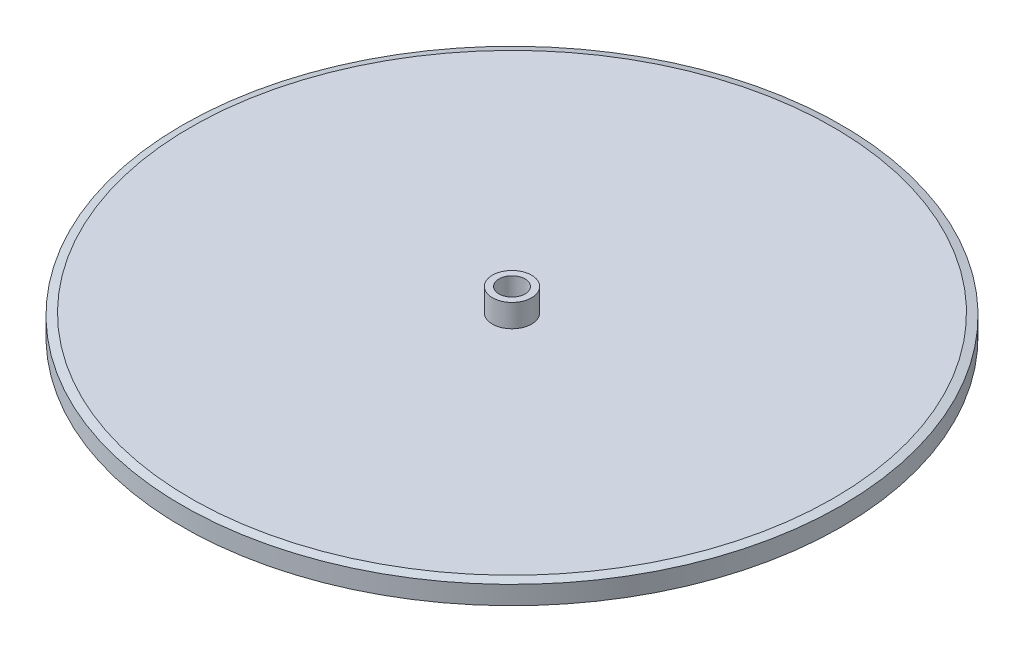
ISO-10303-21;
HEADER;
FILE_DESCRIPTION(('STEP AP214'),'2;1');
FILE_NAME('part.step','',(''),(''),'','','');
FILE_SCHEMA(('AUTOMOTIVE_DESIGN { 1 0 10303 214 1 1 1 1 }'));
ENDSEC;
DATA;
#1=APPLICATION_CONTEXT('core data for automotive mechanical design processes');
#2=APPLICATION_PROTOCOL_DEFINITION('international standard','automotive_design',2000,#1);
#3=PRODUCT_CONTEXT('',#1,'mechanical');
#4=PRODUCT('Part','Part','',(#3));
#5=PRODUCT_RELATED_PRODUCT_CATEGORY('part','',(#4));
#6=PRODUCT_DEFINITION_FORMATION('','',#4);
#7=PRODUCT_DEFINITION_CONTEXT('part definition',#1,'design');
#8=PRODUCT_DEFINITION('design','',#6,#7);
#9=PRODUCT_DEFINITION_SHAPE('','',#8);
#10=(LENGTH_UNIT() NAMED_UNIT(*) SI_UNIT(.MILLI.,.METRE.));
#11=(NAMED_UNIT(*) PLANE_ANGLE_UNIT() SI_UNIT($,.RADIAN.));
#12=(NAMED_UNIT(*) SI_UNIT($,.STERADIAN.) SOLID_ANGLE_UNIT());
#13=UNCERTAINTY_MEASURE_WITH_UNIT(LENGTH_MEASURE(1.E-05),#10,'distance_accuracy_value','');
#14=(GEOMETRIC_REPRESENTATION_CONTEXT(3) GLOBAL_UNCERTAINTY_ASSIGNED_CONTEXT((#13)) GLOBAL_UNIT_ASSIGNED_CONTEXT((#10,
#11,#12)) REPRESENTATION_CONTEXT('',''));
#15=CARTESIAN_POINT('',(0.,0.,0.));
#16=DIRECTION('',(0.,0.,1.));
#17=DIRECTION('',(1.,0.,0.));
#18=AXIS2_PLACEMENT_3D('',#15,#16,#17);
#19=CARTESIAN_POINT('',(0.,0.,0.));
#20=DIRECTION('',(0.,1.,0.));
#21=DIRECTION('',(-1.,0.,0.));
#22=AXIS2_PLACEMENT_3D('',#19,#20,#21);
#23=PLANE('',#22);
#24=CARTESIAN_POINT('',(0.,0.,0.));
#25=DIRECTION('',(0.,-1.,0.));
#26=DIRECTION('',(1.,0.,0.));
#27=AXIS2_PLACEMENT_3D('',#24,#25,#26);
#28=CIRCLE('',#27,2.);
#29=CARTESIAN_POINT('',(2.,0.,0.));
#30=VERTEX_POINT('',#29);
#31=EDGE_CURVE('E65',#30,#30,#28,.T.);
#32=ORIENTED_EDGE('',*,*,#31,.F.);
#33=EDGE_LOOP('',(#32));
#34=FACE_BOUND('',#33,.T.);
#35=CARTESIAN_POINT('',(0.,0.,0.));
#36=DIRECTION('',(0.,1.,0.));
#37=DIRECTION('',(-1.,0.,0.));
#38=AXIS2_PLACEMENT_3D('',#35,#36,#37);
#39=CIRCLE('',#38,49.25);
#40=CARTESIAN_POINT('',(-49.25,0.,0.));
#41=VERTEX_POINT('',#40);
#42=EDGE_CURVE('E10',#41,#41,#39,.F.);
#43=ORIENTED_EDGE('',*,*,#42,.T.);
#44=EDGE_LOOP('',(#43));
#45=FACE_BOUND('',#44,.T.);
#46=ADVANCED_FACE('F37',(#34,#45),#23,.F.);
#47=CARTESIAN_POINT('',(0.,6.99999999999999,0.));
#48=DIRECTION('',(0.,1.,0.));
#49=DIRECTION('',(-1.,0.,0.));
#50=AXIS2_PLACEMENT_3D('',#47,#48,#49);
#51=CYLINDRICAL_SURFACE('',#50,50.5);
#52=CARTESIAN_POINT('',(0.,0.334936490538905,0.));
#53=DIRECTION('',(0.,1.,0.));
#54=DIRECTION('',(-1.,0.,0.));
#55=AXIS2_PLACEMENT_3D('',#52,#53,#54);
#56=CIRCLE('',#55,50.5);
#57=CARTESIAN_POINT('',(-50.5,0.334936490538904,0.));
#58=VERTEX_POINT('',#57);
#59=EDGE_CURVE('E45',#58,#58,#56,.T.);
#60=ORIENTED_EDGE('',*,*,#59,.T.);
#61=EDGE_LOOP('',(#60));
#62=FACE_BOUND('',#61,.T.);
#63=CARTESIAN_POINT('',(0.,3.1650635094611,0.));
#64=DIRECTION('',(0.,-1.,0.));
#65=DIRECTION('',(1.,0.,0.));
#66=AXIS2_PLACEMENT_3D('',#63,#64,#65);
#67=CIRCLE('',#66,50.5);
#68=CARTESIAN_POINT('',(50.5,3.1650635094611,0.));
#69=VERTEX_POINT('',#68);
#70=EDGE_CURVE('E49',#69,#69,#67,.T.);
#71=ORIENTED_EDGE('',*,*,#70,.T.);
#72=EDGE_LOOP('',(#71));
#73=FACE_BOUND('',#72,.T.);
#74=ADVANCED_FACE('F81',(#62,#73),#51,.T.);
#75=CARTESIAN_POINT('',(50.5,3.5,0.));
#76=DIRECTION('',(0.,-1.,0.));
#77=DIRECTION('',(1.,0.,0.));
#78=AXIS2_PLACEMENT_3D('',#75,#76,#77);
#79=PLANE('',#78);
#80=CARTESIAN_POINT('',(0.,3.5,0.));
#81=DIRECTION('',(0.,-1.,0.));
#82=DIRECTION('',(1.,0.,0.));
#83=AXIS2_PLACEMENT_3D('',#80,#81,#82);
#84=CIRCLE('',#83,49.25);
#85=CARTESIAN_POINT('',(49.25,3.5,0.));
#86=VERTEX_POINT('',#85);
#87=EDGE_CURVE('E53',#86,#86,#84,.F.);
#88=ORIENTED_EDGE('',*,*,#87,.T.);
#89=EDGE_LOOP('',(#88));
#90=FACE_BOUND('',#89,.T.);
#91=CARTESIAN_POINT('',(0.,3.49999999999999,0.));
#92=DIRECTION('',(0.,1.,0.));
#93=DIRECTION('',(-1.,0.,0.));
#94=AXIS2_PLACEMENT_3D('',#91,#92,#93);
#95=CIRCLE('',#94,3.);
#96=CARTESIAN_POINT('',(-3.,3.49999999999999,0.));
#97=VERTEX_POINT('',#96);
#98=EDGE_CURVE('E58',#97,#97,#95,.T.);
#99=ORIENTED_EDGE('',*,*,#98,.F.);
#100=EDGE_LOOP('',(#99));
#101=FACE_BOUND('',#100,.T.);
#102=ADVANCED_FACE('F86',(#90,#101),#79,.F.);
#103=CARTESIAN_POINT('',(0.,6.99999999999999,0.));
#104=DIRECTION('',(0.,1.,0.));
#105=DIRECTION('',(-1.,0.,0.));
#106=AXIS2_PLACEMENT_3D('',#103,#104,#105);
#107=CYLINDRICAL_SURFACE('',#106,3.);
#108=CARTESIAN_POINT('',(0.,6.99999999999999,0.));
#109=DIRECTION('',(0.,1.,0.));
#110=DIRECTION('',(-1.,0.,0.));
#111=AXIS2_PLACEMENT_3D('',#108,#109,#110);
#112=CIRCLE('',#111,3.);
#113=CARTESIAN_POINT('',(-3.,6.99999999999999,0.));
#114=VERTEX_POINT('',#113);
#115=EDGE_CURVE('E61',#114,#114,#112,.T.);
#116=ORIENTED_EDGE('',*,*,#115,.F.);
#117=EDGE_LOOP('',(#116));
#118=FACE_BOUND('',#117,.T.);
#119=ORIENTED_EDGE('',*,*,#98,.T.);
#120=EDGE_LOOP('',(#119));
#121=FACE_BOUND('',#120,.T.);
#122=ADVANCED_FACE('F100',(#118,#121),#107,.T.);
#123=CARTESIAN_POINT('',(3.,6.99999999999999,0.));
#124=DIRECTION('',(0.,-1.,0.));
#125=DIRECTION('',(1.,0.,0.));
#126=AXIS2_PLACEMENT_3D('',#123,#124,#125);
#127=PLANE('',#126);
#128=CARTESIAN_POINT('',(0.,7.,0.));
#129=DIRECTION('',(0.,-1.,0.));
#130=DIRECTION('',(1.,0.,0.));
#131=AXIS2_PLACEMENT_3D('',#128,#129,#130);
#132=CIRCLE('',#131,2.);
#133=CARTESIAN_POINT('',(2.,7.,0.));
#134=VERTEX_POINT('',#133);
#135=EDGE_CURVE('E64',#134,#134,#132,.T.);
#136=ORIENTED_EDGE('',*,*,#135,.T.);
#137=EDGE_LOOP('',(#136));
#138=FACE_BOUND('',#137,.T.);
#139=ORIENTED_EDGE('',*,*,#115,.T.);
#140=EDGE_LOOP('',(#139));
#141=FACE_BOUND('',#140,.T.);
#142=ADVANCED_FACE('F71',(#138,#141),#127,.F.);
#143=CARTESIAN_POINT('',(0.,3.5,0.));
#144=DIRECTION('',(0.,-1.,0.));
#145=DIRECTION('',(1.,0.,0.));
#146=AXIS2_PLACEMENT_3D('',#143,#144,#145);
#147=CONICAL_SURFACE('',#146,49.25,1.30899693899575);
#148=ORIENTED_EDGE('',*,*,#70,.F.);
#149=EDGE_LOOP('',(#148));
#150=FACE_BOUND('',#149,.T.);
#151=ORIENTED_EDGE('',*,*,#87,.F.);
#152=EDGE_LOOP('',(#151));
#153=FACE_BOUND('',#152,.T.);
#154=ADVANCED_FACE('F90',(#150,#153),#147,.T.);
#155=CARTESIAN_POINT('',(0.,0.334936490538904,0.));
#156=DIRECTION('',(0.,1.,0.));
#157=DIRECTION('',(-1.,0.,0.));
#158=AXIS2_PLACEMENT_3D('',#155,#156,#157);
#159=CONICAL_SURFACE('',#158,50.5,1.30899693899576);
#160=ORIENTED_EDGE('',*,*,#42,.F.);
#161=EDGE_LOOP('',(#160));
#162=FACE_BOUND('',#161,.T.);
#163=ORIENTED_EDGE('',*,*,#59,.F.);
#164=EDGE_LOOP('',(#163));
#165=FACE_BOUND('',#164,.T.);
#166=ADVANCED_FACE('F40',(#162,#165),#159,.T.);
#167=CARTESIAN_POINT('',(0.,7.,0.));
#168=DIRECTION('',(0.,-1.,0.));
#169=DIRECTION('',(1.,0.,0.));
#170=AXIS2_PLACEMENT_3D('',#167,#168,#169);
#171=CYLINDRICAL_SURFACE('',#170,2.);
#172=ORIENTED_EDGE('',*,*,#135,.F.);
#173=EDGE_LOOP('',(#172));
#174=FACE_BOUND('',#173,.T.);
#175=ORIENTED_EDGE('',*,*,#31,.T.);
#176=EDGE_LOOP('',(#175));
#177=FACE_BOUND('',#176,.T.);
#178=ADVANCED_FACE('F74',(#174,#177),#171,.F.);
#179=CLOSED_SHELL('',(#46,#74,#102,#122,#142,#154,#166,#178));
#180=MANIFOLD_SOLID_BREP('B2',#179);
#181=ADVANCED_BREP_SHAPE_REPRESENTATION('',(#18,#180),#14);
#182=SHAPE_DEFINITION_REPRESENTATION(#9,#181);
ENDSEC;
END-ISO-10303-21;
